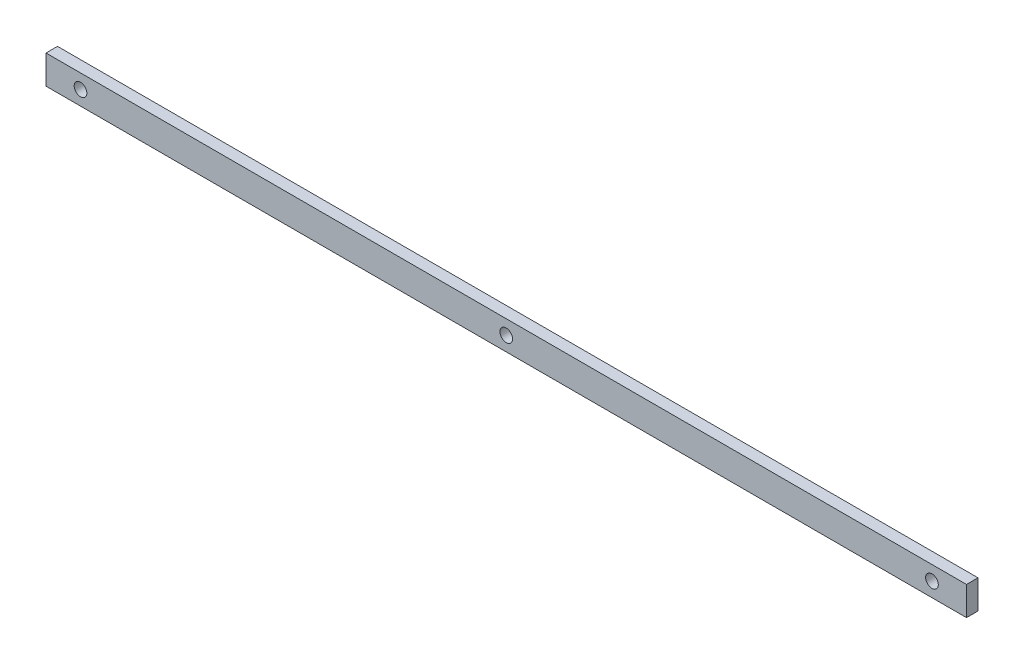
ISO-10303-21;
HEADER;
FILE_DESCRIPTION(('STEP AP214'),'2;1');
FILE_NAME('part.step','',(''),(''),'','','');
FILE_SCHEMA(('AUTOMOTIVE_DESIGN { 1 0 10303 214 1 1 1 1 }'));
ENDSEC;
DATA;
#1=APPLICATION_CONTEXT('core data for automotive mechanical design processes');
#2=APPLICATION_PROTOCOL_DEFINITION('international standard','automotive_design',2000,#1);
#3=PRODUCT_CONTEXT('',#1,'mechanical');
#4=PRODUCT('Part','Part','',(#3));
#5=PRODUCT_RELATED_PRODUCT_CATEGORY('part','',(#4));
#6=PRODUCT_DEFINITION_FORMATION('','',#4);
#7=PRODUCT_DEFINITION_CONTEXT('part definition',#1,'design');
#8=PRODUCT_DEFINITION('design','',#6,#7);
#9=PRODUCT_DEFINITION_SHAPE('','',#8);
#10=(LENGTH_UNIT() NAMED_UNIT(*) SI_UNIT(.MILLI.,.METRE.));
#11=(NAMED_UNIT(*) PLANE_ANGLE_UNIT() SI_UNIT($,.RADIAN.));
#12=(NAMED_UNIT(*) SI_UNIT($,.STERADIAN.) SOLID_ANGLE_UNIT());
#13=UNCERTAINTY_MEASURE_WITH_UNIT(LENGTH_MEASURE(1.E-05),#10,'distance_accuracy_value','');
#14=(GEOMETRIC_REPRESENTATION_CONTEXT(3) GLOBAL_UNCERTAINTY_ASSIGNED_CONTEXT((#13)) GLOBAL_UNIT_ASSIGNED_CONTEXT((#10,
#11,#12)) REPRESENTATION_CONTEXT('',''));
#15=CARTESIAN_POINT('',(0.,0.,0.));
#16=DIRECTION('',(0.,0.,1.));
#17=DIRECTION('',(1.,0.,0.));
#18=AXIS2_PLACEMENT_3D('',#15,#16,#17);
#19=CARTESIAN_POINT('',(400.,12.5,10.));
#20=DIRECTION('',(-1.,0.,0.));
#21=DIRECTION('',(0.,0.,1.));
#22=AXIS2_PLACEMENT_3D('',#19,#20,#21);
#23=PLANE('',#22);
#24=DIRECTION('',(0.,1.,0.));
#25=VECTOR('',#24,1.);
#26=CARTESIAN_POINT('',(400.,12.5,0.));
#27=LINE('',#26,#25);
#28=CARTESIAN_POINT('',(400.,-12.5,0.));
#29=VERTEX_POINT('',#28);
#30=CARTESIAN_POINT('',(400.,12.5,0.));
#31=VERTEX_POINT('',#30);
#32=EDGE_CURVE('E107',#29,#31,#27,.T.);
#33=ORIENTED_EDGE('',*,*,#32,.T.);
#34=DIRECTION('',(0.,0.,-1.));
#35=VECTOR('',#34,1.);
#36=CARTESIAN_POINT('',(400.,12.5,10.));
#37=LINE('',#36,#35);
#38=CARTESIAN_POINT('',(400.,12.5,10.));
#39=VERTEX_POINT('',#38);
#40=EDGE_CURVE('E11',#39,#31,#37,.T.);
#41=ORIENTED_EDGE('',*,*,#40,.F.);
#42=DIRECTION('',(0.,1.,0.));
#43=VECTOR('',#42,1.);
#44=CARTESIAN_POINT('',(400.,12.5,10.));
#45=LINE('',#44,#43);
#46=CARTESIAN_POINT('',(400.,-12.5,10.));
#47=VERTEX_POINT('',#46);
#48=EDGE_CURVE('E91',#47,#39,#45,.T.);
#49=ORIENTED_EDGE('',*,*,#48,.F.);
#50=DIRECTION('',(0.,0.,-1.));
#51=VECTOR('',#50,1.);
#52=CARTESIAN_POINT('',(400.,-12.5,10.));
#53=LINE('',#52,#51);
#54=EDGE_CURVE('E103',#47,#29,#53,.T.);
#55=ORIENTED_EDGE('',*,*,#54,.T.);
#56=EDGE_LOOP('',(#33,#41,#49,#55));
#57=FACE_BOUND('',#56,.T.);
#58=ADVANCED_FACE('F39',(#57),#23,.F.);
#59=CARTESIAN_POINT('',(-400.,12.5,10.));
#60=DIRECTION('',(0.,-1.,0.));
#61=DIRECTION('',(0.,0.,-1.));
#62=AXIS2_PLACEMENT_3D('',#59,#60,#61);
#63=PLANE('',#62);
#64=DIRECTION('',(-1.,0.,0.));
#65=VECTOR('',#64,1.);
#66=CARTESIAN_POINT('',(-400.,12.5,0.));
#67=LINE('',#66,#65);
#68=CARTESIAN_POINT('',(-400.,12.5,0.));
#69=VERTEX_POINT('',#68);
#70=EDGE_CURVE('E96',#31,#69,#67,.T.);
#71=ORIENTED_EDGE('',*,*,#70,.T.);
#72=DIRECTION('',(0.,0.,-1.));
#73=VECTOR('',#72,1.);
#74=CARTESIAN_POINT('',(-400.,12.5,10.));
#75=LINE('',#74,#73);
#76=CARTESIAN_POINT('',(-400.,12.5,10.));
#77=VERTEX_POINT('',#76);
#78=EDGE_CURVE('E48',#77,#69,#75,.T.);
#79=ORIENTED_EDGE('',*,*,#78,.F.);
#80=DIRECTION('',(-1.,0.,0.));
#81=VECTOR('',#80,1.);
#82=CARTESIAN_POINT('',(-400.,12.5,10.));
#83=LINE('',#82,#81);
#84=EDGE_CURVE('E86',#39,#77,#83,.T.);
#85=ORIENTED_EDGE('',*,*,#84,.F.);
#86=ORIENTED_EDGE('',*,*,#40,.T.);
#87=EDGE_LOOP('',(#71,#79,#85,#86));
#88=FACE_BOUND('',#87,.T.);
#89=ADVANCED_FACE('F95',(#88),#63,.F.);
#90=CARTESIAN_POINT('',(-400.,12.5,10.));
#91=DIRECTION('',(1.,0.,0.));
#92=DIRECTION('',(0.,0.,-1.));
#93=AXIS2_PLACEMENT_3D('',#90,#91,#92);
#94=PLANE('',#93);
#95=DIRECTION('',(0.,-1.,0.));
#96=VECTOR('',#95,1.);
#97=CARTESIAN_POINT('',(-400.,12.5,0.));
#98=LINE('',#97,#96);
#99=CARTESIAN_POINT('',(-400.,-12.5,0.));
#100=VERTEX_POINT('',#99);
#101=EDGE_CURVE('E73',#69,#100,#98,.T.);
#102=ORIENTED_EDGE('',*,*,#101,.T.);
#103=DIRECTION('',(0.,0.,-1.));
#104=VECTOR('',#103,1.);
#105=CARTESIAN_POINT('',(-400.,-12.5,10.));
#106=LINE('',#105,#104);
#107=CARTESIAN_POINT('',(-400.,-12.5,10.));
#108=VERTEX_POINT('',#107);
#109=EDGE_CURVE('E98',#108,#100,#106,.T.);
#110=ORIENTED_EDGE('',*,*,#109,.F.);
#111=DIRECTION('',(0.,-1.,0.));
#112=VECTOR('',#111,1.);
#113=CARTESIAN_POINT('',(-400.,12.5,10.));
#114=LINE('',#113,#112);
#115=EDGE_CURVE('E89',#77,#108,#114,.T.);
#116=ORIENTED_EDGE('',*,*,#115,.F.);
#117=ORIENTED_EDGE('',*,*,#78,.T.);
#118=EDGE_LOOP('',(#102,#110,#116,#117));
#119=FACE_BOUND('',#118,.T.);
#120=ADVANCED_FACE('F99',(#119),#94,.F.);
#121=CARTESIAN_POINT('',(-400.,-12.5,10.));
#122=DIRECTION('',(0.,1.,0.));
#123=DIRECTION('',(0.,0.,1.));
#124=AXIS2_PLACEMENT_3D('',#121,#122,#123);
#125=PLANE('',#124);
#126=DIRECTION('',(1.,0.,0.));
#127=VECTOR('',#126,1.);
#128=CARTESIAN_POINT('',(-400.,-12.5,0.));
#129=LINE('',#128,#127);
#130=EDGE_CURVE('E79',#100,#29,#129,.T.);
#131=ORIENTED_EDGE('',*,*,#130,.T.);
#132=ORIENTED_EDGE('',*,*,#54,.F.);
#133=DIRECTION('',(1.,0.,0.));
#134=VECTOR('',#133,1.);
#135=CARTESIAN_POINT('',(-400.,-12.5,10.));
#136=LINE('',#135,#134);
#137=EDGE_CURVE('E56',#108,#47,#136,.T.);
#138=ORIENTED_EDGE('',*,*,#137,.F.);
#139=ORIENTED_EDGE('',*,*,#109,.T.);
#140=EDGE_LOOP('',(#131,#132,#138,#139));
#141=FACE_BOUND('',#140,.T.);
#142=ADVANCED_FACE('F121',(#141),#125,.F.);
#143=CARTESIAN_POINT('',(0.,0.,10.));
#144=DIRECTION('',(0.,0.,1.));
#145=DIRECTION('',(1.,0.,0.));
#146=AXIS2_PLACEMENT_3D('',#143,#144,#145);
#147=PLANE('',#146);
#148=CARTESIAN_POINT('',(370.,0.,10.));
#149=DIRECTION('',(0.,0.,1.));
#150=DIRECTION('',(1.,0.,0.));
#151=AXIS2_PLACEMENT_3D('',#148,#149,#150);
#152=CIRCLE('',#151,5.50000000000002);
#153=CARTESIAN_POINT('',(375.5,0.,10.));
#154=VERTEX_POINT('',#153);
#155=EDGE_CURVE('E111',#154,#154,#152,.F.);
#156=ORIENTED_EDGE('',*,*,#155,.T.);
#157=EDGE_LOOP('',(#156));
#158=FACE_BOUND('',#157,.T.);
#159=CARTESIAN_POINT('',(-370.,0.,10.));
#160=DIRECTION('',(0.,0.,1.));
#161=DIRECTION('',(1.,0.,0.));
#162=AXIS2_PLACEMENT_3D('',#159,#160,#161);
#163=CIRCLE('',#162,5.50000000000002);
#164=CARTESIAN_POINT('',(-364.5,0.,10.));
#165=VERTEX_POINT('',#164);
#166=EDGE_CURVE('E131',#165,#165,#163,.F.);
#167=ORIENTED_EDGE('',*,*,#166,.T.);
#168=EDGE_LOOP('',(#167));
#169=FACE_BOUND('',#168,.T.);
#170=CARTESIAN_POINT('',(0.,0.,10.));
#171=DIRECTION('',(0.,0.,1.));
#172=DIRECTION('',(1.,0.,0.));
#173=AXIS2_PLACEMENT_3D('',#170,#171,#172);
#174=CIRCLE('',#173,5.5);
#175=CARTESIAN_POINT('',(5.5,0.,10.));
#176=VERTEX_POINT('',#175);
#177=EDGE_CURVE('E135',#176,#176,#174,.F.);
#178=ORIENTED_EDGE('',*,*,#177,.T.);
#179=EDGE_LOOP('',(#178));
#180=FACE_BOUND('',#179,.T.);
#181=ORIENTED_EDGE('',*,*,#48,.T.);
#182=ORIENTED_EDGE('',*,*,#84,.T.);
#183=ORIENTED_EDGE('',*,*,#115,.T.);
#184=ORIENTED_EDGE('',*,*,#137,.T.);
#185=EDGE_LOOP('',(#181,#182,#183,#184));
#186=FACE_BOUND('',#185,.T.);
#187=ADVANCED_FACE('F87',(#158,#169,#180,#186),#147,.T.);
#188=CARTESIAN_POINT('',(0.,0.,0.));
#189=DIRECTION('',(0.,0.,1.));
#190=DIRECTION('',(1.,0.,0.));
#191=AXIS2_PLACEMENT_3D('',#188,#189,#190);
#192=PLANE('',#191);
#193=CARTESIAN_POINT('',(370.,0.,0.));
#194=DIRECTION('',(0.,0.,1.));
#195=DIRECTION('',(1.,0.,0.));
#196=AXIS2_PLACEMENT_3D('',#193,#194,#195);
#197=CIRCLE('',#196,5.50000000000002);
#198=CARTESIAN_POINT('',(375.5,0.,0.));
#199=VERTEX_POINT('',#198);
#200=EDGE_CURVE('E139',#199,#199,#197,.T.);
#201=ORIENTED_EDGE('',*,*,#200,.T.);
#202=EDGE_LOOP('',(#201));
#203=FACE_BOUND('',#202,.T.);
#204=CARTESIAN_POINT('',(-370.,0.,0.));
#205=DIRECTION('',(0.,0.,1.));
#206=DIRECTION('',(1.,0.,0.));
#207=AXIS2_PLACEMENT_3D('',#204,#205,#206);
#208=CIRCLE('',#207,5.50000000000002);
#209=CARTESIAN_POINT('',(-364.5,0.,0.));
#210=VERTEX_POINT('',#209);
#211=EDGE_CURVE('E144',#210,#210,#208,.T.);
#212=ORIENTED_EDGE('',*,*,#211,.T.);
#213=EDGE_LOOP('',(#212));
#214=FACE_BOUND('',#213,.T.);
#215=CARTESIAN_POINT('',(0.,0.,0.));
#216=DIRECTION('',(0.,0.,1.));
#217=DIRECTION('',(1.,0.,0.));
#218=AXIS2_PLACEMENT_3D('',#215,#216,#217);
#219=CIRCLE('',#218,5.5);
#220=CARTESIAN_POINT('',(5.5,0.,0.));
#221=VERTEX_POINT('',#220);
#222=EDGE_CURVE('E140',#221,#221,#219,.T.);
#223=ORIENTED_EDGE('',*,*,#222,.T.);
#224=EDGE_LOOP('',(#223));
#225=FACE_BOUND('',#224,.T.);
#226=ORIENTED_EDGE('',*,*,#32,.F.);
#227=ORIENTED_EDGE('',*,*,#130,.F.);
#228=ORIENTED_EDGE('',*,*,#101,.F.);
#229=ORIENTED_EDGE('',*,*,#70,.F.);
#230=EDGE_LOOP('',(#226,#227,#228,#229));
#231=FACE_BOUND('',#230,.T.);
#232=ADVANCED_FACE('F124',(#203,#214,#225,#231),#192,.F.);
#233=CARTESIAN_POINT('',(0.,0.,20.));
#234=DIRECTION('',(0.,0.,-1.));
#235=DIRECTION('',(-1.,0.,0.));
#236=AXIS2_PLACEMENT_3D('',#233,#234,#235);
#237=CYLINDRICAL_SURFACE('',#236,5.5);
#238=ORIENTED_EDGE('',*,*,#177,.F.);
#239=EDGE_LOOP('',(#238));
#240=FACE_BOUND('',#239,.T.);
#241=ORIENTED_EDGE('',*,*,#222,.F.);
#242=EDGE_LOOP('',(#241));
#243=FACE_BOUND('',#242,.T.);
#244=ADVANCED_FACE('F162',(#240,#243),#237,.F.);
#245=CARTESIAN_POINT('',(-370.,0.,20.));
#246=DIRECTION('',(0.,0.,-1.));
#247=DIRECTION('',(-1.,0.,0.));
#248=AXIS2_PLACEMENT_3D('',#245,#246,#247);
#249=CYLINDRICAL_SURFACE('',#248,5.50000000000002);
#250=ORIENTED_EDGE('',*,*,#166,.F.);
#251=EDGE_LOOP('',(#250));
#252=FACE_BOUND('',#251,.T.);
#253=ORIENTED_EDGE('',*,*,#211,.F.);
#254=EDGE_LOOP('',(#253));
#255=FACE_BOUND('',#254,.T.);
#256=ADVANCED_FACE('F156',(#252,#255),#249,.F.);
#257=CARTESIAN_POINT('',(370.,0.,20.));
#258=DIRECTION('',(0.,0.,-1.));
#259=DIRECTION('',(-1.,0.,0.));
#260=AXIS2_PLACEMENT_3D('',#257,#258,#259);
#261=CYLINDRICAL_SURFACE('',#260,5.50000000000002);
#262=ORIENTED_EDGE('',*,*,#155,.F.);
#263=EDGE_LOOP('',(#262));
#264=FACE_BOUND('',#263,.T.);
#265=ORIENTED_EDGE('',*,*,#200,.F.);
#266=EDGE_LOOP('',(#265));
#267=FACE_BOUND('',#266,.T.);
#268=ADVANCED_FACE('F154',(#264,#267),#261,.F.);
#269=CLOSED_SHELL('',(#58,#89,#120,#142,#187,#232,#244,#256,#268));
#270=MANIFOLD_SOLID_BREP('B2',#269);
#271=ADVANCED_BREP_SHAPE_REPRESENTATION('',(#18,#270),#14);
#272=SHAPE_DEFINITION_REPRESENTATION(#9,#271);
ENDSEC;
END-ISO-10303-21;
